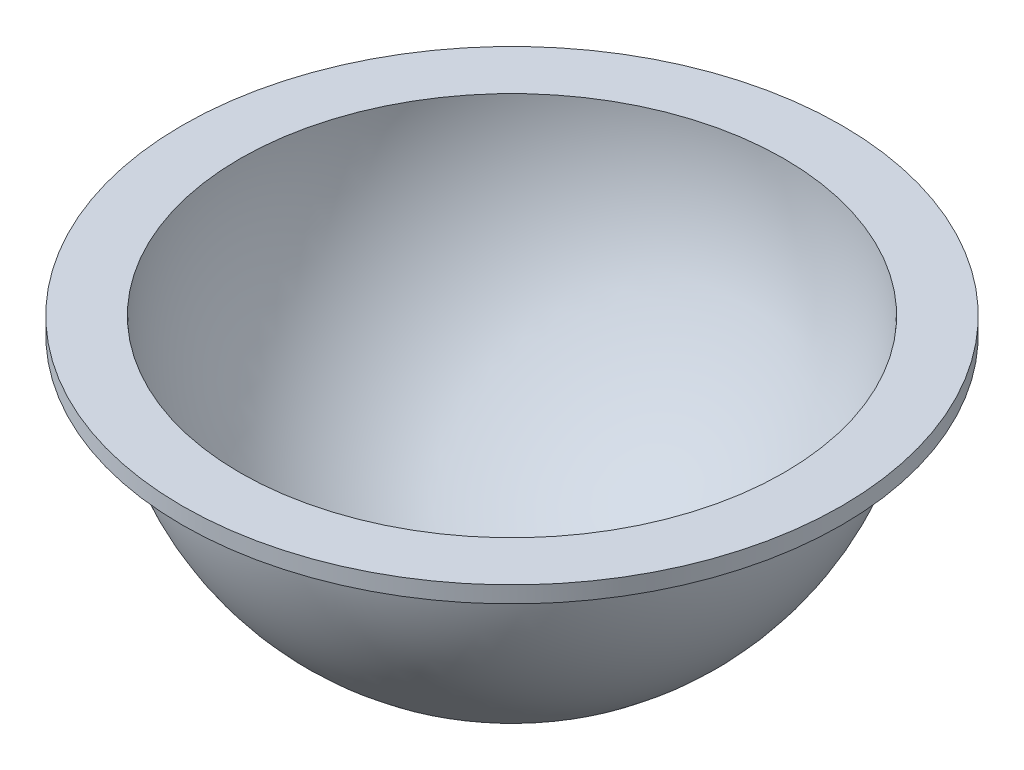
ISO-10303-21;
HEADER;
FILE_DESCRIPTION(('STEP AP214'),'2;1');
FILE_NAME('part.step','',(''),(''),'','','');
FILE_SCHEMA(('AUTOMOTIVE_DESIGN { 1 0 10303 214 1 1 1 1 }'));
ENDSEC;
DATA;
#1=APPLICATION_CONTEXT('core data for automotive mechanical design processes');
#2=APPLICATION_PROTOCOL_DEFINITION('international standard','automotive_design',2000,#1);
#3=PRODUCT_CONTEXT('',#1,'mechanical');
#4=PRODUCT('Part','Part','',(#3));
#5=PRODUCT_RELATED_PRODUCT_CATEGORY('part','',(#4));
#6=PRODUCT_DEFINITION_FORMATION('','',#4);
#7=PRODUCT_DEFINITION_CONTEXT('part definition',#1,'design');
#8=PRODUCT_DEFINITION('design','',#6,#7);
#9=PRODUCT_DEFINITION_SHAPE('','',#8);
#10=(LENGTH_UNIT() NAMED_UNIT(*) SI_UNIT(.MILLI.,.METRE.));
#11=(NAMED_UNIT(*) PLANE_ANGLE_UNIT() SI_UNIT($,.RADIAN.));
#12=(NAMED_UNIT(*) SI_UNIT($,.STERADIAN.) SOLID_ANGLE_UNIT());
#13=UNCERTAINTY_MEASURE_WITH_UNIT(LENGTH_MEASURE(1.E-05),#10,'distance_accuracy_value','');
#14=(GEOMETRIC_REPRESENTATION_CONTEXT(3) GLOBAL_UNCERTAINTY_ASSIGNED_CONTEXT((#13)) GLOBAL_UNIT_ASSIGNED_CONTEXT((#10,
#11,#12)) REPRESENTATION_CONTEXT('',''));
#15=CARTESIAN_POINT('',(0.,0.,0.));
#16=DIRECTION('',(0.,0.,1.));
#17=DIRECTION('',(1.,0.,0.));
#18=AXIS2_PLACEMENT_3D('',#15,#16,#17);
#19=CARTESIAN_POINT('',(0.,0.,0.));
#20=DIRECTION('',(0.,-1.,0.));
#21=DIRECTION('',(0.,0.,-1.));
#22=AXIS2_PLACEMENT_3D('',#19,#20,#21);
#23=PLANE('',#22);
#24=CARTESIAN_POINT('',(0.,0.,0.));
#25=DIRECTION('',(0.,-1.,0.));
#26=DIRECTION('',(0.,0.,-1.));
#27=AXIS2_PLACEMENT_3D('',#24,#25,#26);
#28=CIRCLE('',#27,66.);
#29=CARTESIAN_POINT('',(0.,0.,-66.));
#30=VERTEX_POINT('',#29);
#31=EDGE_CURVE('E40',#30,#30,#28,.T.);
#32=ORIENTED_EDGE('',*,*,#31,.T.);
#33=EDGE_LOOP('',(#32));
#34=FACE_BOUND('',#33,.T.);
#35=CARTESIAN_POINT('',(0.,0.,0.));
#36=DIRECTION('',(0.,1.,0.));
#37=DIRECTION('',(0.,0.,1.));
#38=AXIS2_PLACEMENT_3D('',#35,#36,#37);
#39=CIRCLE('',#38,80.);
#40=CARTESIAN_POINT('',(0.,0.,80.));
#41=VERTEX_POINT('',#40);
#42=EDGE_CURVE('E48',#41,#41,#39,.T.);
#43=ORIENTED_EDGE('',*,*,#42,.T.);
#44=EDGE_LOOP('',(#43));
#45=FACE_BOUND('',#44,.T.);
#46=ADVANCED_FACE('F33',(#34,#45),#23,.F.);
#47=CARTESIAN_POINT('',(0.,0.,0.));
#48=DIRECTION('',(0.,1.,0.));
#49=DIRECTION('',(1.,0.,0.));
#50=AXIS2_PLACEMENT_3D('',#47,#48,#49);
#51=SPHERICAL_SURFACE('',#50,66.);
#52=ORIENTED_EDGE('',*,*,#31,.F.);
#53=EDGE_LOOP('',(#52));
#54=FACE_BOUND('',#53,.T.);
#55=ADVANCED_FACE('F58',(#54),#51,.F.);
#56=CARTESIAN_POINT('',(0.,-4.,0.));
#57=DIRECTION('',(0.,1.,0.));
#58=DIRECTION('',(0.,0.,1.));
#59=AXIS2_PLACEMENT_3D('',#56,#57,#58);
#60=CYLINDRICAL_SURFACE('',#59,80.);
#61=CARTESIAN_POINT('',(0.,-4.,0.));
#62=DIRECTION('',(0.,1.,0.));
#63=DIRECTION('',(0.,0.,1.));
#64=AXIS2_PLACEMENT_3D('',#61,#62,#63);
#65=CIRCLE('',#64,80.);
#66=CARTESIAN_POINT('',(0.,-4.,80.));
#67=VERTEX_POINT('',#66);
#68=EDGE_CURVE('E44',#67,#67,#65,.T.);
#69=ORIENTED_EDGE('',*,*,#68,.T.);
#70=EDGE_LOOP('',(#69));
#71=FACE_BOUND('',#70,.T.);
#72=ORIENTED_EDGE('',*,*,#42,.F.);
#73=EDGE_LOOP('',(#72));
#74=FACE_BOUND('',#73,.T.);
#75=ADVANCED_FACE('F55',(#71,#74),#60,.T.);
#76=CARTESIAN_POINT('',(0.,-4.,0.));
#77=DIRECTION('',(0.,1.,0.));
#78=DIRECTION('',(0.,0.,1.));
#79=AXIS2_PLACEMENT_3D('',#76,#77,#78);
#80=PLANE('',#79);
#81=CARTESIAN_POINT('',(0.,-4.,0.));
#82=DIRECTION('',(0.,1.,0.));
#83=DIRECTION('',(0.,0.,1.));
#84=AXIS2_PLACEMENT_3D('',#81,#82,#83);
#85=CIRCLE('',#84,69.8856208386246);
#86=CARTESIAN_POINT('',(0.,-4.,69.8856208386246));
#87=VERTEX_POINT('',#86);
#88=EDGE_CURVE('E10',#87,#87,#85,.T.);
#89=ORIENTED_EDGE('',*,*,#88,.T.);
#90=EDGE_LOOP('',(#89));
#91=FACE_BOUND('',#90,.T.);
#92=ORIENTED_EDGE('',*,*,#68,.F.);
#93=EDGE_LOOP('',(#92));
#94=FACE_BOUND('',#93,.T.);
#95=ADVANCED_FACE('F57',(#91,#94),#80,.F.);
#96=CARTESIAN_POINT('',(0.,0.,0.));
#97=DIRECTION('',(0.,1.,0.));
#98=DIRECTION('',(1.,0.,0.));
#99=AXIS2_PLACEMENT_3D('',#96,#97,#98);
#100=SPHERICAL_SURFACE('',#99,70.);
#101=ORIENTED_EDGE('',*,*,#88,.F.);
#102=EDGE_LOOP('',(#101));
#103=FACE_BOUND('',#102,.T.);
#104=ADVANCED_FACE('F35',(#103),#100,.T.);
#105=CLOSED_SHELL('',(#46,#55,#75,#95,#104));
#106=MANIFOLD_SOLID_BREP('B2',#105);
#107=ADVANCED_BREP_SHAPE_REPRESENTATION('',(#18,#106),#14);
#108=SHAPE_DEFINITION_REPRESENTATION(#9,#107);
ENDSEC;
END-ISO-10303-21;
